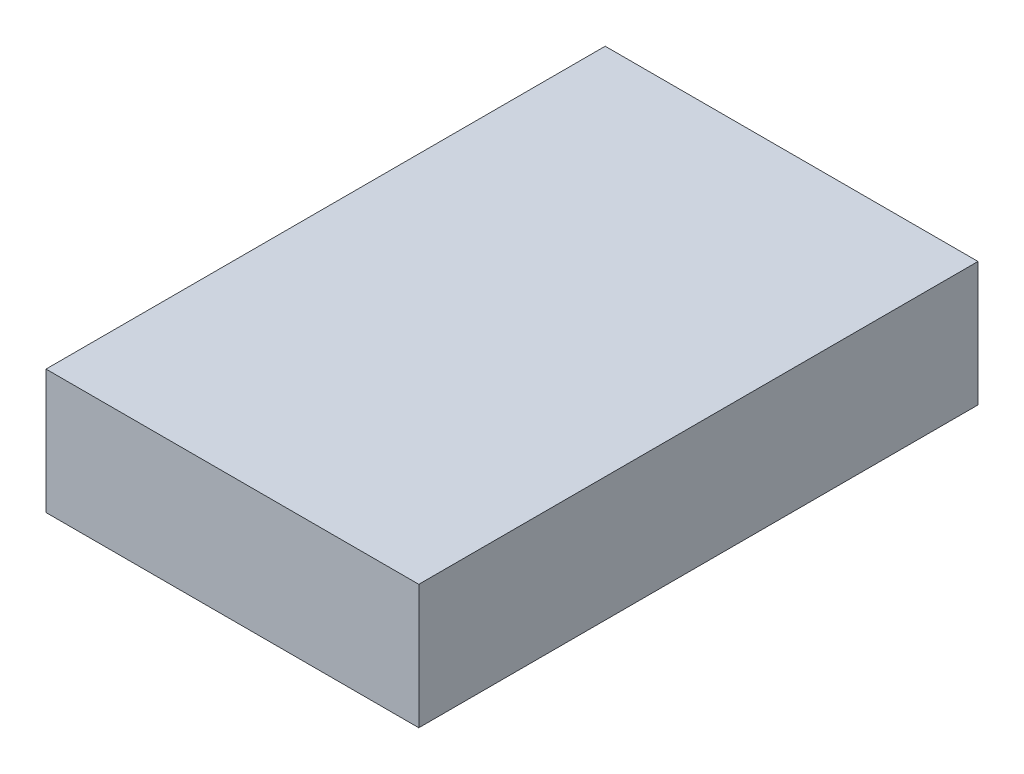
ISO-10303-21;
HEADER;
FILE_DESCRIPTION(('STEP AP214'),'2;1');
FILE_NAME('part.step','',(''),(''),'','','');
FILE_SCHEMA(('AUTOMOTIVE_DESIGN { 1 0 10303 214 1 1 1 1 }'));
ENDSEC;
DATA;
#1=APPLICATION_CONTEXT('core data for automotive mechanical design processes');
#2=APPLICATION_PROTOCOL_DEFINITION('international standard','automotive_design',2000,#1);
#3=PRODUCT_CONTEXT('',#1,'mechanical');
#4=PRODUCT('Part','Part','',(#3));
#5=PRODUCT_RELATED_PRODUCT_CATEGORY('part','',(#4));
#6=PRODUCT_DEFINITION_FORMATION('','',#4);
#7=PRODUCT_DEFINITION_CONTEXT('part definition',#1,'design');
#8=PRODUCT_DEFINITION('design','',#6,#7);
#9=PRODUCT_DEFINITION_SHAPE('','',#8);
#10=(LENGTH_UNIT() NAMED_UNIT(*) SI_UNIT(.MILLI.,.METRE.));
#11=(NAMED_UNIT(*) PLANE_ANGLE_UNIT() SI_UNIT($,.RADIAN.));
#12=(NAMED_UNIT(*) SI_UNIT($,.STERADIAN.) SOLID_ANGLE_UNIT());
#13=UNCERTAINTY_MEASURE_WITH_UNIT(LENGTH_MEASURE(1.E-05),#10,'distance_accuracy_value','');
#14=(GEOMETRIC_REPRESENTATION_CONTEXT(3) GLOBAL_UNCERTAINTY_ASSIGNED_CONTEXT((#13)) GLOBAL_UNIT_ASSIGNED_CONTEXT((#10,
#11,#12)) REPRESENTATION_CONTEXT('',''));
#15=CARTESIAN_POINT('',(0.,0.,0.));
#16=DIRECTION('',(0.,0.,1.));
#17=DIRECTION('',(1.,0.,0.));
#18=AXIS2_PLACEMENT_3D('',#15,#16,#17);
#19=CARTESIAN_POINT('',(0.,203.2,0.));
#20=DIRECTION('',(1.,0.,0.));
#21=DIRECTION('',(0.,0.,-1.));
#22=AXIS2_PLACEMENT_3D('',#19,#20,#21);
#23=PLANE('',#22);
#24=DIRECTION('',(0.,0.,1.));
#25=VECTOR('',#24,1.);
#26=CARTESIAN_POINT('',(0.,0.,0.));
#27=LINE('',#26,#25);
#28=CARTESIAN_POINT('',(0.,0.,-914.4));
#29=VERTEX_POINT('',#28);
#30=CARTESIAN_POINT('',(0.,0.,0.));
#31=VERTEX_POINT('',#30);
#32=EDGE_CURVE('E107',#29,#31,#27,.T.);
#33=ORIENTED_EDGE('',*,*,#32,.T.);
#34=DIRECTION('',(0.,-1.,0.));
#35=VECTOR('',#34,1.);
#36=CARTESIAN_POINT('',(0.,203.2,0.));
#37=LINE('',#36,#35);
#38=CARTESIAN_POINT('',(0.,203.2,0.));
#39=VERTEX_POINT('',#38);
#40=EDGE_CURVE('E11',#39,#31,#37,.T.);
#41=ORIENTED_EDGE('',*,*,#40,.F.);
#42=DIRECTION('',(0.,0.,1.));
#43=VECTOR('',#42,1.);
#44=CARTESIAN_POINT('',(0.,203.2,0.));
#45=LINE('',#44,#43);
#46=CARTESIAN_POINT('',(0.,203.2,-914.4));
#47=VERTEX_POINT('',#46);
#48=EDGE_CURVE('E91',#47,#39,#45,.T.);
#49=ORIENTED_EDGE('',*,*,#48,.F.);
#50=DIRECTION('',(0.,-1.,0.));
#51=VECTOR('',#50,1.);
#52=CARTESIAN_POINT('',(0.,203.2,-914.4));
#53=LINE('',#52,#51);
#54=EDGE_CURVE('E103',#47,#29,#53,.T.);
#55=ORIENTED_EDGE('',*,*,#54,.T.);
#56=EDGE_LOOP('',(#33,#41,#49,#55));
#57=FACE_BOUND('',#56,.T.);
#58=ADVANCED_FACE('F39',(#57),#23,.F.);
#59=CARTESIAN_POINT('',(0.,203.2,0.));
#60=DIRECTION('',(0.,0.,-1.));
#61=DIRECTION('',(-1.,0.,0.));
#62=AXIS2_PLACEMENT_3D('',#59,#60,#61);
#63=PLANE('',#62);
#64=DIRECTION('',(1.,0.,0.));
#65=VECTOR('',#64,1.);
#66=CARTESIAN_POINT('',(0.,0.,0.));
#67=LINE('',#66,#65);
#68=CARTESIAN_POINT('',(609.6,0.,0.));
#69=VERTEX_POINT('',#68);
#70=EDGE_CURVE('E96',#31,#69,#67,.T.);
#71=ORIENTED_EDGE('',*,*,#70,.T.);
#72=DIRECTION('',(0.,-1.,0.));
#73=VECTOR('',#72,1.);
#74=CARTESIAN_POINT('',(609.6,203.2,0.));
#75=LINE('',#74,#73);
#76=CARTESIAN_POINT('',(609.6,203.2,0.));
#77=VERTEX_POINT('',#76);
#78=EDGE_CURVE('E48',#77,#69,#75,.T.);
#79=ORIENTED_EDGE('',*,*,#78,.F.);
#80=DIRECTION('',(1.,0.,0.));
#81=VECTOR('',#80,1.);
#82=CARTESIAN_POINT('',(0.,203.2,0.));
#83=LINE('',#82,#81);
#84=EDGE_CURVE('E86',#39,#77,#83,.T.);
#85=ORIENTED_EDGE('',*,*,#84,.F.);
#86=ORIENTED_EDGE('',*,*,#40,.T.);
#87=EDGE_LOOP('',(#71,#79,#85,#86));
#88=FACE_BOUND('',#87,.T.);
#89=ADVANCED_FACE('F95',(#88),#63,.F.);
#90=CARTESIAN_POINT('',(609.6,203.2,0.));
#91=DIRECTION('',(-1.,0.,0.));
#92=DIRECTION('',(0.,0.,1.));
#93=AXIS2_PLACEMENT_3D('',#90,#91,#92);
#94=PLANE('',#93);
#95=DIRECTION('',(0.,0.,-1.));
#96=VECTOR('',#95,1.);
#97=CARTESIAN_POINT('',(609.6,0.,0.));
#98=LINE('',#97,#96);
#99=CARTESIAN_POINT('',(609.6,0.,-914.4));
#100=VERTEX_POINT('',#99);
#101=EDGE_CURVE('E73',#69,#100,#98,.T.);
#102=ORIENTED_EDGE('',*,*,#101,.T.);
#103=DIRECTION('',(0.,-1.,0.));
#104=VECTOR('',#103,1.);
#105=CARTESIAN_POINT('',(609.6,203.2,-914.4));
#106=LINE('',#105,#104);
#107=CARTESIAN_POINT('',(609.6,203.2,-914.4));
#108=VERTEX_POINT('',#107);
#109=EDGE_CURVE('E98',#108,#100,#106,.T.);
#110=ORIENTED_EDGE('',*,*,#109,.F.);
#111=DIRECTION('',(0.,0.,-1.));
#112=VECTOR('',#111,1.);
#113=CARTESIAN_POINT('',(609.6,203.2,0.));
#114=LINE('',#113,#112);
#115=EDGE_CURVE('E89',#77,#108,#114,.T.);
#116=ORIENTED_EDGE('',*,*,#115,.F.);
#117=ORIENTED_EDGE('',*,*,#78,.T.);
#118=EDGE_LOOP('',(#102,#110,#116,#117));
#119=FACE_BOUND('',#118,.T.);
#120=ADVANCED_FACE('F99',(#119),#94,.F.);
#121=CARTESIAN_POINT('',(0.,203.2,-914.4));
#122=DIRECTION('',(0.,0.,1.));
#123=DIRECTION('',(1.,0.,0.));
#124=AXIS2_PLACEMENT_3D('',#121,#122,#123);
#125=PLANE('',#124);
#126=DIRECTION('',(-1.,0.,0.));
#127=VECTOR('',#126,1.);
#128=CARTESIAN_POINT('',(0.,0.,-914.4));
#129=LINE('',#128,#127);
#130=EDGE_CURVE('E79',#100,#29,#129,.T.);
#131=ORIENTED_EDGE('',*,*,#130,.T.);
#132=ORIENTED_EDGE('',*,*,#54,.F.);
#133=DIRECTION('',(-1.,0.,0.));
#134=VECTOR('',#133,1.);
#135=CARTESIAN_POINT('',(0.,203.2,-914.4));
#136=LINE('',#135,#134);
#137=EDGE_CURVE('E56',#108,#47,#136,.T.);
#138=ORIENTED_EDGE('',*,*,#137,.F.);
#139=ORIENTED_EDGE('',*,*,#109,.T.);
#140=EDGE_LOOP('',(#131,#132,#138,#139));
#141=FACE_BOUND('',#140,.T.);
#142=ADVANCED_FACE('F120',(#141),#125,.F.);
#143=CARTESIAN_POINT('',(0.,203.2,0.));
#144=DIRECTION('',(0.,-1.,0.));
#145=DIRECTION('',(0.,0.,-1.));
#146=AXIS2_PLACEMENT_3D('',#143,#144,#145);
#147=PLANE('',#146);
#148=ORIENTED_EDGE('',*,*,#48,.T.);
#149=ORIENTED_EDGE('',*,*,#84,.T.);
#150=ORIENTED_EDGE('',*,*,#115,.T.);
#151=ORIENTED_EDGE('',*,*,#137,.T.);
#152=EDGE_LOOP('',(#148,#149,#150,#151));
#153=FACE_BOUND('',#152,.T.);
#154=ADVANCED_FACE('F87',(#153),#147,.F.);
#155=CARTESIAN_POINT('',(0.,0.,0.));
#156=DIRECTION('',(0.,-1.,0.));
#157=DIRECTION('',(0.,0.,-1.));
#158=AXIS2_PLACEMENT_3D('',#155,#156,#157);
#159=PLANE('',#158);
#160=ORIENTED_EDGE('',*,*,#32,.F.);
#161=ORIENTED_EDGE('',*,*,#130,.F.);
#162=ORIENTED_EDGE('',*,*,#101,.F.);
#163=ORIENTED_EDGE('',*,*,#70,.F.);
#164=EDGE_LOOP('',(#160,#161,#162,#163));
#165=FACE_BOUND('',#164,.T.);
#166=ADVANCED_FACE('F123',(#165),#159,.T.);
#167=CLOSED_SHELL('',(#58,#89,#120,#142,#154,#166));
#168=MANIFOLD_SOLID_BREP('B2',#167);
#169=ADVANCED_BREP_SHAPE_REPRESENTATION('',(#18,#168),#14);
#170=SHAPE_DEFINITION_REPRESENTATION(#9,#169);
ENDSEC;
END-ISO-10303-21;
